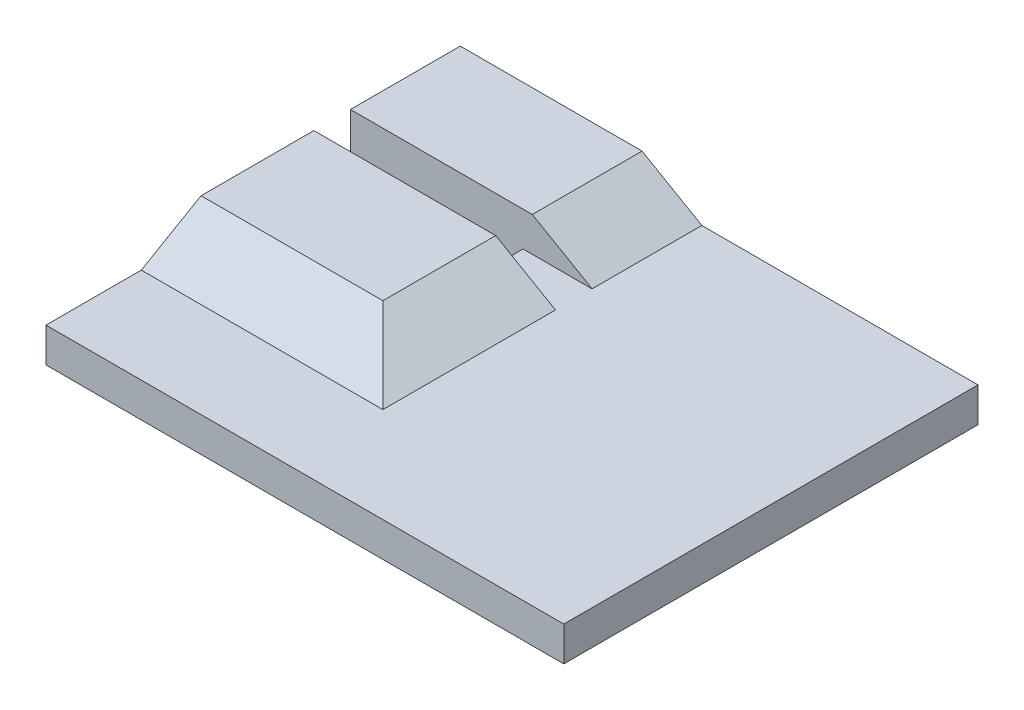
ISO-10303-21;
HEADER;
FILE_DESCRIPTION(('STEP AP214'),'2;1');
FILE_NAME('part.step','',(''),(''),'','','');
FILE_SCHEMA(('AUTOMOTIVE_DESIGN { 1 0 10303 214 1 1 1 1 }'));
ENDSEC;
DATA;
#1=APPLICATION_CONTEXT('core data for automotive mechanical design processes');
#2=APPLICATION_PROTOCOL_DEFINITION('international standard','automotive_design',2000,#1);
#3=PRODUCT_CONTEXT('',#1,'mechanical');
#4=PRODUCT('Part','Part','',(#3));
#5=PRODUCT_RELATED_PRODUCT_CATEGORY('part','',(#4));
#6=PRODUCT_DEFINITION_FORMATION('','',#4);
#7=PRODUCT_DEFINITION_CONTEXT('part definition',#1,'design');
#8=PRODUCT_DEFINITION('design','',#6,#7);
#9=PRODUCT_DEFINITION_SHAPE('','',#8);
#10=(LENGTH_UNIT() NAMED_UNIT(*) SI_UNIT(.MILLI.,.METRE.));
#11=(NAMED_UNIT(*) PLANE_ANGLE_UNIT() SI_UNIT($,.RADIAN.));
#12=(NAMED_UNIT(*) SI_UNIT($,.STERADIAN.) SOLID_ANGLE_UNIT());
#13=UNCERTAINTY_MEASURE_WITH_UNIT(LENGTH_MEASURE(1.E-05),#10,'distance_accuracy_value','');
#14=(GEOMETRIC_REPRESENTATION_CONTEXT(3) GLOBAL_UNCERTAINTY_ASSIGNED_CONTEXT((#13)) GLOBAL_UNIT_ASSIGNED_CONTEXT((#10,
#11,#12)) REPRESENTATION_CONTEXT('',''));
#15=CARTESIAN_POINT('',(0.,0.,0.));
#16=DIRECTION('',(0.,0.,1.));
#17=DIRECTION('',(1.,0.,0.));
#18=AXIS2_PLACEMENT_3D('',#15,#16,#17);
#19=CARTESIAN_POINT('',(0.,2.5,0.));
#20=DIRECTION('',(0.,-1.,0.));
#21=DIRECTION('',(0.,0.,-1.));
#22=AXIS2_PLACEMENT_3D('',#19,#20,#21);
#23=PLANE('',#22);
#24=DIRECTION('',(-1.,0.,0.));
#25=VECTOR('',#24,1.);
#26=CARTESIAN_POINT('',(0.,2.5,-10.));
#27=LINE('',#26,#25);
#28=CARTESIAN_POINT('',(18.75,2.5,-10.));
#29=VERTEX_POINT('',#28);
#30=CARTESIAN_POINT('',(-1.24999999999999,2.5,-10.));
#31=VERTEX_POINT('',#30);
#32=EDGE_CURVE('E254',#29,#31,#27,.T.);
#33=ORIENTED_EDGE('',*,*,#32,.T.);
#34=DIRECTION('',(0.,0.,1.));
#35=VECTOR('',#34,1.);
#36=CARTESIAN_POINT('',(-1.24999999999999,2.5,-2.05000000000024));
#37=LINE('',#36,#35);
#38=CARTESIAN_POINT('',(-1.24999999999999,2.5,-2.05000000000024));
#39=VERTEX_POINT('',#38);
#40=EDGE_CURVE('E187',#31,#39,#37,.T.);
#41=ORIENTED_EDGE('',*,*,#40,.T.);
#42=DIRECTION('',(-1.,0.,0.));
#43=VECTOR('',#42,1.);
#44=CARTESIAN_POINT('',(-18.75,2.5,-2.05000000000024));
#45=LINE('',#44,#43);
#46=CARTESIAN_POINT('',(-6.25000000000001,2.5,-2.05000000000024));
#47=VERTEX_POINT('',#46);
#48=EDGE_CURVE('E185',#39,#47,#45,.T.);
#49=ORIENTED_EDGE('',*,*,#48,.T.);
#50=DIRECTION('',(0.,0.,1.));
#51=VECTOR('',#50,1.);
#52=CARTESIAN_POINT('',(-6.25000000000001,2.5,0.599999999999763));
#53=LINE('',#52,#51);
#54=CARTESIAN_POINT('',(-6.25000000000001,2.5,0.599999999999763));
#55=VERTEX_POINT('',#54);
#56=EDGE_CURVE('E219',#47,#55,#53,.T.);
#57=ORIENTED_EDGE('',*,*,#56,.T.);
#58=DIRECTION('',(1.,0.,0.));
#59=VECTOR('',#58,1.);
#60=CARTESIAN_POINT('',(-18.75,2.5,0.599999999999763));
#61=LINE('',#60,#59);
#62=CARTESIAN_POINT('',(-1.24999999999999,2.5,0.599999999999763));
#63=VERTEX_POINT('',#62);
#64=EDGE_CURVE('E59',#55,#63,#61,.T.);
#65=ORIENTED_EDGE('',*,*,#64,.T.);
#66=DIRECTION('',(0.,0.,1.));
#67=VECTOR('',#66,1.);
#68=CARTESIAN_POINT('',(-1.24999999999998,2.5,8.09999999999976));
#69=LINE('',#68,#67);
#70=CARTESIAN_POINT('',(-1.24999999999998,2.5,13.0999999999998));
#71=VERTEX_POINT('',#70);
#72=EDGE_CURVE('E179',#63,#71,#69,.T.);
#73=ORIENTED_EDGE('',*,*,#72,.T.);
#74=DIRECTION('',(-1.,0.,0.));
#75=VECTOR('',#74,1.);
#76=CARTESIAN_POINT('',(-18.75,2.5,13.0999999999998));
#77=LINE('',#76,#75);
#78=CARTESIAN_POINT('',(-18.75,2.5,13.0999999999998));
#79=VERTEX_POINT('',#78);
#80=EDGE_CURVE('E182',#71,#79,#77,.T.);
#81=ORIENTED_EDGE('',*,*,#80,.T.);
#82=DIRECTION('',(0.,0.,1.));
#83=VECTOR('',#82,1.);
#84=CARTESIAN_POINT('',(-18.75,2.5,20.));
#85=LINE('',#84,#83);
#86=CARTESIAN_POINT('',(-18.75,2.5,20.));
#87=VERTEX_POINT('',#86);
#88=EDGE_CURVE('E243',#79,#87,#85,.T.);
#89=ORIENTED_EDGE('',*,*,#88,.T.);
#90=DIRECTION('',(1.,0.,0.));
#91=VECTOR('',#90,1.);
#92=CARTESIAN_POINT('',(-18.75,2.5,20.));
#93=LINE('',#92,#91);
#94=CARTESIAN_POINT('',(18.75,2.5,20.));
#95=VERTEX_POINT('',#94);
#96=EDGE_CURVE('E176',#87,#95,#93,.T.);
#97=ORIENTED_EDGE('',*,*,#96,.T.);
#98=DIRECTION('',(0.,0.,-1.));
#99=VECTOR('',#98,1.);
#100=CARTESIAN_POINT('',(18.75,2.5,20.));
#101=LINE('',#100,#99);
#102=EDGE_CURVE('E166',#95,#29,#101,.T.);
#103=ORIENTED_EDGE('',*,*,#102,.T.);
#104=EDGE_LOOP('',(#33,#41,#49,#57,#65,#73,#81,#89,#97,#103));
#105=FACE_BOUND('',#104,.T.);
#106=ADVANCED_FACE('F41',(#105),#23,.F.);
#107=CARTESIAN_POINT('',(-18.75,2.5,20.));
#108=DIRECTION('',(1.,0.,0.));
#109=DIRECTION('',(0.,0.,-1.));
#110=AXIS2_PLACEMENT_3D('',#107,#108,#109);
#111=PLANE('',#110);
#112=ORIENTED_EDGE('',*,*,#88,.F.);
#113=DIRECTION('',(0.,-0.500000000000006,0.866025403784435));
#114=VECTOR('',#113,1.);
#115=CARTESIAN_POINT('',(-18.75,-0.487787643056428,18.2749999999999));
#116=LINE('',#115,#114);
#117=CARTESIAN_POINT('',(-18.75,5.,8.76987298107765));
#118=VERTEX_POINT('',#117);
#119=EDGE_CURVE('E198',#79,#118,#116,.F.);
#120=ORIENTED_EDGE('',*,*,#119,.T.);
#121=DIRECTION('',(0.,0.,1.));
#122=VECTOR('',#121,1.);
#123=CARTESIAN_POINT('',(-18.75,5.,0.599999999999763));
#124=LINE('',#123,#122);
#125=CARTESIAN_POINT('',(-18.75,5.,0.599999999999763));
#126=VERTEX_POINT('',#125);
#127=EDGE_CURVE('E256',#126,#118,#124,.T.);
#128=ORIENTED_EDGE('',*,*,#127,.F.);
#129=DIRECTION('',(0.,-1.,0.));
#130=VECTOR('',#129,1.);
#131=CARTESIAN_POINT('',(-18.75,2.5,0.599999999999763));
#132=LINE('',#131,#130);
#133=CARTESIAN_POINT('',(-18.75,0.,0.599999999999763));
#134=VERTEX_POINT('',#133);
#135=EDGE_CURVE('E232',#126,#134,#132,.T.);
#136=ORIENTED_EDGE('',*,*,#135,.T.);
#137=DIRECTION('',(0.,0.,1.));
#138=VECTOR('',#137,1.);
#139=CARTESIAN_POINT('',(-18.75,0.,20.));
#140=LINE('',#139,#138);
#141=CARTESIAN_POINT('',(-18.75,0.,20.));
#142=VERTEX_POINT('',#141);
#143=EDGE_CURVE('E164',#134,#142,#140,.T.);
#144=ORIENTED_EDGE('',*,*,#143,.T.);
#145=DIRECTION('',(0.,-1.,0.));
#146=VECTOR('',#145,1.);
#147=CARTESIAN_POINT('',(-18.75,2.5,20.));
#148=LINE('',#147,#146);
#149=EDGE_CURVE('E175',#87,#142,#148,.T.);
#150=ORIENTED_EDGE('',*,*,#149,.F.);
#151=EDGE_LOOP('',(#112,#120,#128,#136,#144,#150));
#152=FACE_BOUND('',#151,.T.);
#153=ADVANCED_FACE('F267',(#152),#111,.F.);
#154=CARTESIAN_POINT('',(18.75,2.5,20.));
#155=DIRECTION('',(-1.,0.,0.));
#156=DIRECTION('',(0.,0.,1.));
#157=AXIS2_PLACEMENT_3D('',#154,#155,#156);
#158=PLANE('',#157);
#159=DIRECTION('',(0.,0.,-1.));
#160=VECTOR('',#159,1.);
#161=CARTESIAN_POINT('',(18.75,0.,20.));
#162=LINE('',#161,#160);
#163=CARTESIAN_POINT('',(18.75,0.,20.));
#164=VERTEX_POINT('',#163);
#165=CARTESIAN_POINT('',(18.75,0.,-10.));
#166=VERTEX_POINT('',#165);
#167=EDGE_CURVE('E168',#164,#166,#162,.T.);
#168=ORIENTED_EDGE('',*,*,#167,.T.);
#169=DIRECTION('',(0.,1.,0.));
#170=VECTOR('',#169,1.);
#171=CARTESIAN_POINT('',(18.75,0.,-10.));
#172=LINE('',#171,#170);
#173=EDGE_CURVE('E144',#166,#29,#172,.T.);
#174=ORIENTED_EDGE('',*,*,#173,.T.);
#175=ORIENTED_EDGE('',*,*,#102,.F.);
#176=DIRECTION('',(0.,-1.,0.));
#177=VECTOR('',#176,1.);
#178=CARTESIAN_POINT('',(18.75,2.5,20.));
#179=LINE('',#178,#177);
#180=EDGE_CURVE('E172',#95,#164,#179,.T.);
#181=ORIENTED_EDGE('',*,*,#180,.T.);
#182=EDGE_LOOP('',(#168,#174,#175,#181));
#183=FACE_BOUND('',#182,.T.);
#184=ADVANCED_FACE('F253',(#183),#158,.F.);
#185=DIRECTION('',(0.,0.,1.));
#186=VECTOR('',#185,1.);
#187=CARTESIAN_POINT('',(-18.75,5.,-2.05000000000024));
#188=LINE('',#187,#186);
#189=CARTESIAN_POINT('',(-18.75,5.,-10.));
#190=VERTEX_POINT('',#189);
#191=CARTESIAN_POINT('',(-18.75,5.,-2.05000000000024));
#192=VERTEX_POINT('',#191);
#193=EDGE_CURVE('E156',#190,#192,#188,.T.);
#194=ORIENTED_EDGE('',*,*,#193,.F.);
#195=DIRECTION('',(0.,1.,0.));
#196=VECTOR('',#195,1.);
#197=CARTESIAN_POINT('',(-18.75,0.,-10.));
#198=LINE('',#197,#196);
#199=CARTESIAN_POINT('',(-18.75,0.,-10.));
#200=VERTEX_POINT('',#199);
#201=EDGE_CURVE('E142',#200,#190,#198,.T.);
#202=ORIENTED_EDGE('',*,*,#201,.F.);
#203=CARTESIAN_POINT('',(-18.75,0.,-2.05000000000024));
#204=VERTEX_POINT('',#203);
#205=EDGE_CURVE('E154',#200,#204,#140,.T.);
#206=ORIENTED_EDGE('',*,*,#205,.T.);
#207=DIRECTION('',(0.,-1.,0.));
#208=VECTOR('',#207,1.);
#209=CARTESIAN_POINT('',(-18.75,2.5,-2.05000000000024));
#210=LINE('',#209,#208);
#211=EDGE_CURVE('E224',#192,#204,#210,.T.);
#212=ORIENTED_EDGE('',*,*,#211,.F.);
#213=EDGE_LOOP('',(#194,#202,#206,#212));
#214=FACE_BOUND('',#213,.T.);
#215=ADVANCED_FACE('F152',(#214),#111,.F.);
#216=CARTESIAN_POINT('',(-18.75,2.5,20.));
#217=DIRECTION('',(0.,0.,-1.));
#218=DIRECTION('',(-1.,0.,0.));
#219=AXIS2_PLACEMENT_3D('',#216,#217,#218);
#220=PLANE('',#219);
#221=DIRECTION('',(1.,0.,0.));
#222=VECTOR('',#221,1.);
#223=CARTESIAN_POINT('',(-18.75,0.,20.));
#224=LINE('',#223,#222);
#225=EDGE_CURVE('E163',#142,#164,#224,.T.);
#226=ORIENTED_EDGE('',*,*,#225,.T.);
#227=ORIENTED_EDGE('',*,*,#180,.F.);
#228=ORIENTED_EDGE('',*,*,#96,.F.);
#229=ORIENTED_EDGE('',*,*,#149,.T.);
#230=EDGE_LOOP('',(#226,#227,#228,#229));
#231=FACE_BOUND('',#230,.T.);
#232=ADVANCED_FACE('F250',(#231),#220,.F.);
#233=CARTESIAN_POINT('',(0.,0.,0.));
#234=DIRECTION('',(0.,-1.,0.));
#235=DIRECTION('',(0.,0.,-1.));
#236=AXIS2_PLACEMENT_3D('',#233,#234,#235);
#237=PLANE('',#236);
#238=DIRECTION('',(1.,0.,0.));
#239=VECTOR('',#238,1.);
#240=CARTESIAN_POINT('',(-18.75,0.,-10.));
#241=LINE('',#240,#239);
#242=EDGE_CURVE('E139',#200,#166,#241,.T.);
#243=ORIENTED_EDGE('',*,*,#242,.T.);
#244=ORIENTED_EDGE('',*,*,#167,.F.);
#245=ORIENTED_EDGE('',*,*,#225,.F.);
#246=ORIENTED_EDGE('',*,*,#143,.F.);
#247=DIRECTION('',(-1.,0.,0.));
#248=VECTOR('',#247,1.);
#249=CARTESIAN_POINT('',(-18.75,0.,0.599999999999763));
#250=LINE('',#249,#248);
#251=CARTESIAN_POINT('',(-6.25000000000001,0.,0.599999999999763));
#252=VERTEX_POINT('',#251);
#253=EDGE_CURVE('E225',#252,#134,#250,.T.);
#254=ORIENTED_EDGE('',*,*,#253,.F.);
#255=DIRECTION('',(0.,0.,1.));
#256=VECTOR('',#255,1.);
#257=CARTESIAN_POINT('',(-6.25000000000001,0.,0.599999999999763));
#258=LINE('',#257,#256);
#259=CARTESIAN_POINT('',(-6.25000000000001,0.,-2.05000000000024));
#260=VERTEX_POINT('',#259);
#261=EDGE_CURVE('E230',#260,#252,#258,.T.);
#262=ORIENTED_EDGE('',*,*,#261,.F.);
#263=DIRECTION('',(1.,0.,0.));
#264=VECTOR('',#263,1.);
#265=CARTESIAN_POINT('',(-18.75,0.,-2.05000000000024));
#266=LINE('',#265,#264);
#267=EDGE_CURVE('E162',#204,#260,#266,.T.);
#268=ORIENTED_EDGE('',*,*,#267,.F.);
#269=ORIENTED_EDGE('',*,*,#205,.F.);
#270=EDGE_LOOP('',(#243,#244,#245,#246,#254,#262,#268,#269));
#271=FACE_BOUND('',#270,.T.);
#272=ADVANCED_FACE('F159',(#271),#237,.T.);
#273=CARTESIAN_POINT('',(-18.75,2.5,0.599999999999763));
#274=DIRECTION('',(0.,0.,1.));
#275=DIRECTION('',(1.,0.,0.));
#276=AXIS2_PLACEMENT_3D('',#273,#274,#275);
#277=PLANE('',#276);
#278=ORIENTED_EDGE('',*,*,#253,.T.);
#279=ORIENTED_EDGE('',*,*,#135,.F.);
#280=DIRECTION('',(-1.,0.,0.));
#281=VECTOR('',#280,1.);
#282=CARTESIAN_POINT('',(-18.75,5.,0.599999999999763));
#283=LINE('',#282,#281);
#284=CARTESIAN_POINT('',(-5.58012701892211,5.,0.599999999999763));
#285=VERTEX_POINT('',#284);
#286=EDGE_CURVE('E207',#285,#126,#283,.T.);
#287=ORIENTED_EDGE('',*,*,#286,.F.);
#288=DIRECTION('',(-0.866025403784435,0.500000000000006,0.));
#289=VECTOR('',#288,1.);
#290=CARTESIAN_POINT('',(-14.3749999999999,10.0777222831139,0.599999999999763));
#291=LINE('',#290,#289);
#292=EDGE_CURVE('E11',#285,#63,#291,.F.);
#293=ORIENTED_EDGE('',*,*,#292,.T.);
#294=ORIENTED_EDGE('',*,*,#64,.F.);
#295=DIRECTION('',(0.,-1.,0.));
#296=VECTOR('',#295,1.);
#297=CARTESIAN_POINT('',(-6.25000000000001,2.5,0.599999999999763));
#298=LINE('',#297,#296);
#299=EDGE_CURVE('E228',#55,#252,#298,.T.);
#300=ORIENTED_EDGE('',*,*,#299,.T.);
#301=EDGE_LOOP('',(#278,#279,#287,#293,#294,#300));
#302=FACE_BOUND('',#301,.T.);
#303=ADVANCED_FACE('F214',(#302),#277,.F.);
#304=CARTESIAN_POINT('',(-6.25000000000001,2.5,0.599999999999763));
#305=DIRECTION('',(1.,0.,0.));
#306=DIRECTION('',(0.,0.,-1.));
#307=AXIS2_PLACEMENT_3D('',#304,#305,#306);
#308=PLANE('',#307);
#309=ORIENTED_EDGE('',*,*,#261,.T.);
#310=ORIENTED_EDGE('',*,*,#299,.F.);
#311=ORIENTED_EDGE('',*,*,#56,.F.);
#312=DIRECTION('',(0.,-1.,0.));
#313=VECTOR('',#312,1.);
#314=CARTESIAN_POINT('',(-6.25000000000001,2.5,-2.05000000000024));
#315=LINE('',#314,#313);
#316=EDGE_CURVE('E233',#47,#260,#315,.T.);
#317=ORIENTED_EDGE('',*,*,#316,.T.);
#318=EDGE_LOOP('',(#309,#310,#311,#317));
#319=FACE_BOUND('',#318,.T.);
#320=ADVANCED_FACE('F229',(#319),#308,.F.);
#321=CARTESIAN_POINT('',(-18.75,2.5,-2.05000000000024));
#322=DIRECTION('',(0.,0.,-1.));
#323=DIRECTION('',(-1.,0.,0.));
#324=AXIS2_PLACEMENT_3D('',#321,#322,#323);
#325=PLANE('',#324);
#326=ORIENTED_EDGE('',*,*,#267,.T.);
#327=ORIENTED_EDGE('',*,*,#316,.F.);
#328=ORIENTED_EDGE('',*,*,#48,.F.);
#329=DIRECTION('',(0.866025403784435,-0.500000000000006,0.));
#330=VECTOR('',#329,1.);
#331=CARTESIAN_POINT('',(-14.3749999999999,10.0777222831139,-2.05000000000024));
#332=LINE('',#331,#330);
#333=CARTESIAN_POINT('',(-5.58012701892211,5.,-2.05000000000024));
#334=VERTEX_POINT('',#333);
#335=EDGE_CURVE('E194',#39,#334,#332,.F.);
#336=ORIENTED_EDGE('',*,*,#335,.T.);
#337=DIRECTION('',(1.,0.,0.));
#338=VECTOR('',#337,1.);
#339=CARTESIAN_POINT('',(-18.75,5.,-2.05000000000024));
#340=LINE('',#339,#338);
#341=EDGE_CURVE('E71',#192,#334,#340,.T.);
#342=ORIENTED_EDGE('',*,*,#341,.F.);
#343=ORIENTED_EDGE('',*,*,#211,.T.);
#344=EDGE_LOOP('',(#326,#327,#328,#336,#342,#343));
#345=FACE_BOUND('',#344,.T.);
#346=ADVANCED_FACE('F286',(#345),#325,.F.);
#347=CARTESIAN_POINT('',(0.,5.,0.));
#348=DIRECTION('',(0.,-1.,0.));
#349=DIRECTION('',(0.,0.,-1.));
#350=AXIS2_PLACEMENT_3D('',#347,#348,#349);
#351=PLANE('',#350);
#352=ORIENTED_EDGE('',*,*,#341,.T.);
#353=DIRECTION('',(0.,0.,1.));
#354=VECTOR('',#353,1.);
#355=CARTESIAN_POINT('',(-5.58012701892211,5.,0.));
#356=LINE('',#355,#354);
#357=CARTESIAN_POINT('',(-5.58012701892213,5.,-10.));
#358=VERTEX_POINT('',#357);
#359=EDGE_CURVE('E190',#334,#358,#356,.F.);
#360=ORIENTED_EDGE('',*,*,#359,.T.);
#361=DIRECTION('',(1.,0.,0.));
#362=VECTOR('',#361,1.);
#363=CARTESIAN_POINT('',(-18.75,5.,-10.));
#364=LINE('',#363,#362);
#365=EDGE_CURVE('E80',#190,#358,#364,.T.);
#366=ORIENTED_EDGE('',*,*,#365,.F.);
#367=ORIENTED_EDGE('',*,*,#193,.T.);
#368=EDGE_LOOP('',(#352,#360,#366,#367));
#369=FACE_BOUND('',#368,.T.);
#370=ADVANCED_FACE('F307',(#369),#351,.F.);
#371=CARTESIAN_POINT('',(0.,5.,0.));
#372=DIRECTION('',(0.,1.,0.));
#373=DIRECTION('',(0.,0.,1.));
#374=AXIS2_PLACEMENT_3D('',#371,#372,#373);
#375=PLANE('',#374);
#376=ORIENTED_EDGE('',*,*,#127,.T.);
#377=DIRECTION('',(-1.,0.,0.));
#378=VECTOR('',#377,1.);
#379=CARTESIAN_POINT('',(-18.75,5.,8.76987298107765));
#380=LINE('',#379,#378);
#381=CARTESIAN_POINT('',(-5.58012701892211,5.,8.76987298107765));
#382=VERTEX_POINT('',#381);
#383=EDGE_CURVE('E196',#118,#382,#380,.F.);
#384=ORIENTED_EDGE('',*,*,#383,.T.);
#385=DIRECTION('',(0.,0.,1.));
#386=VECTOR('',#385,1.);
#387=CARTESIAN_POINT('',(-5.58012701892211,5.,0.599999999999763));
#388=LINE('',#387,#386);
#389=EDGE_CURVE('E52',#382,#285,#388,.F.);
#390=ORIENTED_EDGE('',*,*,#389,.T.);
#391=ORIENTED_EDGE('',*,*,#286,.T.);
#392=EDGE_LOOP('',(#376,#384,#390,#391));
#393=FACE_BOUND('',#392,.T.);
#394=ADVANCED_FACE('F206',(#393),#375,.T.);
#395=CARTESIAN_POINT('',(-18.75,0.,-10.));
#396=DIRECTION('',(0.,0.,1.));
#397=DIRECTION('',(1.,0.,0.));
#398=AXIS2_PLACEMENT_3D('',#395,#396,#397);
#399=PLANE('',#398);
#400=ORIENTED_EDGE('',*,*,#173,.F.);
#401=ORIENTED_EDGE('',*,*,#242,.F.);
#402=ORIENTED_EDGE('',*,*,#201,.T.);
#403=ORIENTED_EDGE('',*,*,#365,.T.);
#404=DIRECTION('',(-0.866025403784435,0.500000000000006,0.));
#405=VECTOR('',#404,1.);
#406=CARTESIAN_POINT('',(-13.2924682452693,9.45272228311388,-10.));
#407=LINE('',#406,#405);
#408=EDGE_CURVE('E192',#358,#31,#407,.F.);
#409=ORIENTED_EDGE('',*,*,#408,.T.);
#410=ORIENTED_EDGE('',*,*,#32,.F.);
#411=EDGE_LOOP('',(#400,#401,#402,#403,#409,#410));
#412=FACE_BOUND('',#411,.T.);
#413=ADVANCED_FACE('F141',(#412),#399,.F.);
#414=CARTESIAN_POINT('',(-6.25000000000001,5.38675134594818,-2.05000000000024));
#415=DIRECTION('',(0.500000000000006,0.866025403784435,0.));
#416=DIRECTION('',(0.,0.,1.));
#417=AXIS2_PLACEMENT_3D('',#414,#415,#416);
#418=PLANE('',#417);
#419=ORIENTED_EDGE('',*,*,#335,.F.);
#420=ORIENTED_EDGE('',*,*,#40,.F.);
#421=ORIENTED_EDGE('',*,*,#408,.F.);
#422=ORIENTED_EDGE('',*,*,#359,.F.);
#423=EDGE_LOOP('',(#419,#420,#421,#422));
#424=FACE_BOUND('',#423,.T.);
#425=ADVANCED_FACE('F274',(#424),#418,.T.);
#426=CARTESIAN_POINT('',(-6.25000000000001,5.38675134594818,0.599999999999763));
#427=DIRECTION('',(0.500000000000006,0.866025403784435,0.));
#428=DIRECTION('',(0.,0.,1.));
#429=AXIS2_PLACEMENT_3D('',#426,#427,#428);
#430=PLANE('',#429);
#431=ORIENTED_EDGE('',*,*,#292,.F.);
#432=ORIENTED_EDGE('',*,*,#389,.F.);
#433=DIRECTION('',(-0.654653670707976,0.377964473009232,-0.654653670707976));
#434=VECTOR('',#433,1.);
#435=CARTESIAN_POINT('',(-11.6071428571428,8.47969921660693,2.74285714285692));
#436=LINE('',#435,#434);
#437=EDGE_CURVE('E46',#71,#382,#436,.T.);
#438=ORIENTED_EDGE('',*,*,#437,.F.);
#439=ORIENTED_EDGE('',*,*,#72,.F.);
#440=EDGE_LOOP('',(#431,#432,#438,#439));
#441=FACE_BOUND('',#440,.T.);
#442=ADVANCED_FACE('F44',(#441),#430,.T.);
#443=CARTESIAN_POINT('',(-18.75,5.38675134594818,8.09999999999976));
#444=DIRECTION('',(0.,0.866025403784435,0.500000000000006));
#445=DIRECTION('',(-1.,0.,0.));
#446=AXIS2_PLACEMENT_3D('',#443,#444,#445);
#447=PLANE('',#446);
#448=ORIENTED_EDGE('',*,*,#119,.F.);
#449=ORIENTED_EDGE('',*,*,#80,.F.);
#450=ORIENTED_EDGE('',*,*,#437,.T.);
#451=ORIENTED_EDGE('',*,*,#383,.F.);
#452=EDGE_LOOP('',(#448,#449,#450,#451));
#453=FACE_BOUND('',#452,.T.);
#454=ADVANCED_FACE('F269',(#453),#447,.T.);
#455=CLOSED_SHELL('',(#106,#153,#184,#215,#232,#272,#303,#320,#346,#370,#394,#413,#425,#442,#454));
#456=MANIFOLD_SOLID_BREP('B2',#455);
#457=ADVANCED_BREP_SHAPE_REPRESENTATION('',(#18,#456),#14);
#458=SHAPE_DEFINITION_REPRESENTATION(#9,#457);
ENDSEC;
END-ISO-10303-21;
